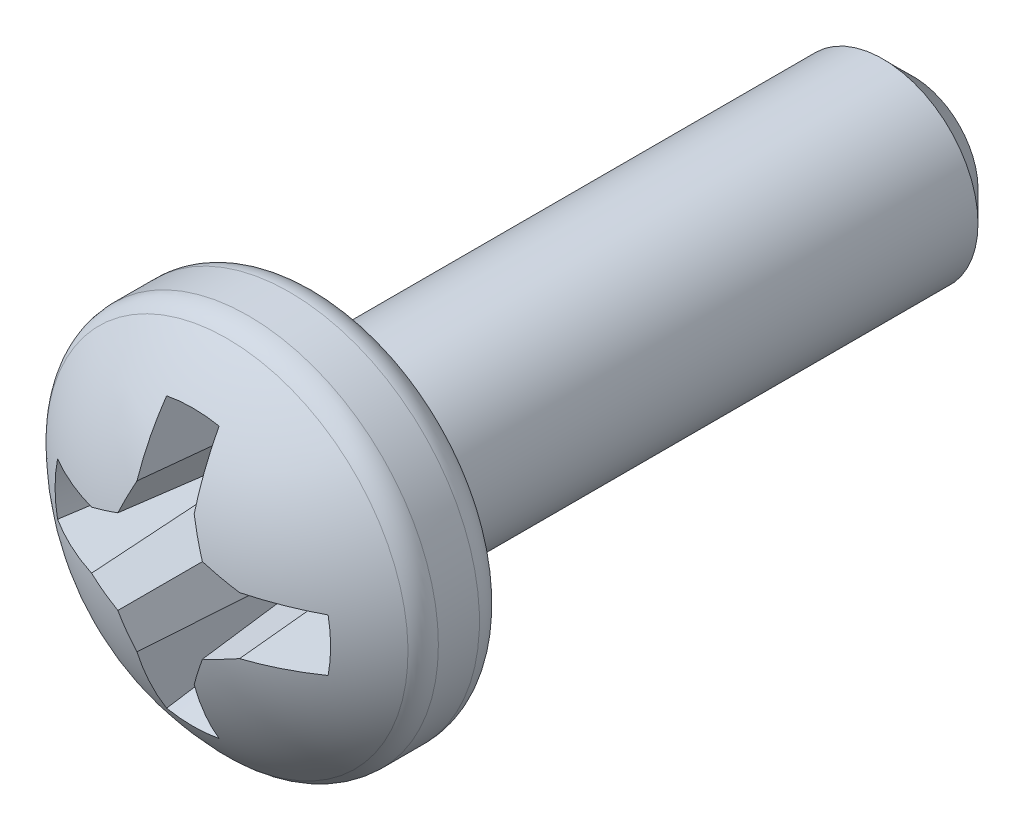
ISO-10303-21;
HEADER;
FILE_DESCRIPTION(('STEP AP214'),'2;1');
FILE_NAME('part.step','',(''),(''),'','','');
FILE_SCHEMA(('AUTOMOTIVE_DESIGN { 1 0 10303 214 1 1 1 1 }'));
ENDSEC;
DATA;
#1=APPLICATION_CONTEXT('core data for automotive mechanical design processes');
#2=APPLICATION_PROTOCOL_DEFINITION('international standard','automotive_design',2000,#1);
#3=PRODUCT_CONTEXT('',#1,'mechanical');
#4=PRODUCT('Part','Part','',(#3));
#5=PRODUCT_RELATED_PRODUCT_CATEGORY('part','',(#4));
#6=PRODUCT_DEFINITION_FORMATION('','',#4);
#7=PRODUCT_DEFINITION_CONTEXT('part definition',#1,'design');
#8=PRODUCT_DEFINITION('design','',#6,#7);
#9=PRODUCT_DEFINITION_SHAPE('','',#8);
#10=(LENGTH_UNIT() NAMED_UNIT(*) SI_UNIT(.MILLI.,.METRE.));
#11=(NAMED_UNIT(*) PLANE_ANGLE_UNIT() SI_UNIT($,.RADIAN.));
#12=(NAMED_UNIT(*) SI_UNIT($,.STERADIAN.) SOLID_ANGLE_UNIT());
#13=UNCERTAINTY_MEASURE_WITH_UNIT(LENGTH_MEASURE(1.E-05),#10,'distance_accuracy_value','');
#14=(GEOMETRIC_REPRESENTATION_CONTEXT(3) GLOBAL_UNCERTAINTY_ASSIGNED_CONTEXT((#13)) GLOBAL_UNIT_ASSIGNED_CONTEXT((#10,
#11,#12)) REPRESENTATION_CONTEXT('',''));
#15=CARTESIAN_POINT('',(0.,0.,0.));
#16=DIRECTION('',(0.,0.,1.));
#17=DIRECTION('',(1.,0.,0.));
#18=AXIS2_PLACEMENT_3D('',#15,#16,#17);
#19=CARTESIAN_POINT('',(-0.572121674615797,0.791461441644268,0.413196607862429));
#20=DIRECTION('',(0.,0.,1.));
#21=DIRECTION('',(1.,0.,0.));
#22=AXIS2_PLACEMENT_3D('',#19,#20,#21);
#23=PLANE('',#22);
#24=DIRECTION('',(0.382683432365081,-0.92387953251129,0.));
#25=VECTOR('',#24,1.);
#26=CARTESIAN_POINT('',(-0.558807787845929,0.796976234112247,0.413196607862429));
#27=LINE('',#26,#25);
#28=CARTESIAN_POINT('',(-0.566378033261302,0.815252423264536,0.413196607862429));
#29=VERTEX_POINT('',#28);
#30=CARTESIAN_POINT('',(-0.561092089679838,0.802491026580226,0.413196607862429));
#31=VERTEX_POINT('',#30);
#32=EDGE_CURVE('E292',#29,#31,#27,.T.);
#33=ORIENTED_EDGE('',*,*,#32,.F.);
#34=DIRECTION('',(0.,1.,0.));
#35=VECTOR('',#34,1.);
#36=CARTESIAN_POINT('',(-0.566378033261302,0.791461441644268,0.413196607862429));
#37=LINE('',#36,#35);
#38=CARTESIAN_POINT('',(-0.566378033261302,0.827667770325216,0.413196607862429));
#39=VERTEX_POINT('',#38);
#40=EDGE_CURVE('E168',#39,#29,#37,.F.);
#41=ORIENTED_EDGE('',*,*,#40,.F.);
#42=CARTESIAN_POINT('',(-0.572121674615797,0.791461441644268,0.413196607862429));
#43=DIRECTION('',(0.,0.,1.));
#44=DIRECTION('',(1.,0.,0.));
#45=AXIS2_PLACEMENT_3D('',#42,#43,#44);
#46=CIRCLE('',#45,0.0366590732638172);
#47=CARTESIAN_POINT('',(-0.577865315970288,0.827667770325217,0.413196607862429));
#48=VERTEX_POINT('',#47);
#49=EDGE_CURVE('E159',#39,#48,#46,.T.);
#50=ORIENTED_EDGE('',*,*,#49,.T.);
#51=DIRECTION('',(0.,1.,0.));
#52=VECTOR('',#51,1.);
#53=CARTESIAN_POINT('',(-0.577865315970287,0.791461441644271,0.413196607862429));
#54=LINE('',#53,#52);
#55=CARTESIAN_POINT('',(-0.577865315970288,0.815252423264539,0.413196607862429));
#56=VERTEX_POINT('',#55);
#57=EDGE_CURVE('E166',#56,#48,#54,.T.);
#58=ORIENTED_EDGE('',*,*,#57,.F.);
#59=DIRECTION('',(0.382683432365079,0.923879532511291,0.));
#60=VECTOR('',#59,1.);
#61=CARTESIAN_POINT('',(-0.585435561385662,0.79697623411225,0.413196607862429));
#62=LINE('',#61,#60);
#63=CARTESIAN_POINT('',(-0.583151259551752,0.802491026580229,0.413196607862429));
#64=VERTEX_POINT('',#63);
#65=EDGE_CURVE('E301',#64,#56,#62,.T.);
#66=ORIENTED_EDGE('',*,*,#65,.F.);
#67=DIRECTION('',(0.923879532511289,0.382683432365086,0.));
#68=VECTOR('',#67,1.);
#69=CARTESIAN_POINT('',(-0.577636467083772,0.804775328414139,0.413196607862429));
#70=LINE('',#69,#68);
#71=CARTESIAN_POINT('',(-0.595912656236062,0.797205082998765,0.413196607862429));
#72=VERTEX_POINT('',#71);
#73=EDGE_CURVE('E307',#72,#64,#70,.T.);
#74=ORIENTED_EDGE('',*,*,#73,.F.);
#75=DIRECTION('',(1.,0.,0.));
#76=VECTOR('',#75,1.);
#77=CARTESIAN_POINT('',(-0.572121674615793,0.797205082998765,0.413196607862429));
#78=LINE('',#77,#76);
#79=CARTESIAN_POINT('',(-0.608328003323473,0.797205082997996,0.413196607853642));
#80=VERTEX_POINT('',#79);
#81=EDGE_CURVE('E313',#80,#72,#78,.T.);
#82=ORIENTED_EDGE('',*,*,#81,.F.);
#83=CARTESIAN_POINT('',(-0.572121674615794,0.791461441644271,0.413196607862429));
#84=DIRECTION('',(0.,0.,1.));
#85=DIRECTION('',(1.,0.,0.));
#86=AXIS2_PLACEMENT_3D('',#83,#84,#85);
#87=CIRCLE('',#86,0.0366590732924525);
#88=CARTESIAN_POINT('',(-0.608328003325736,0.78571780028978,0.413196607862429));
#89=VERTEX_POINT('',#88);
#90=EDGE_CURVE('E410',#80,#89,#87,.T.);
#91=ORIENTED_EDGE('',*,*,#90,.T.);
#92=DIRECTION('',(1.,0.,0.));
#93=VECTOR('',#92,1.);
#94=CARTESIAN_POINT('',(-0.572121674615797,0.78571780028978,0.413196607862429));
#95=LINE('',#94,#93);
#96=CARTESIAN_POINT('',(-0.595912656236065,0.78571780028978,0.413196607862429));
#97=VERTEX_POINT('',#96);
#98=EDGE_CURVE('E247',#97,#89,#95,.F.);
#99=ORIENTED_EDGE('',*,*,#98,.F.);
#100=DIRECTION('',(-0.923879532511292,0.382683432365076,0.));
#101=VECTOR('',#100,1.);
#102=CARTESIAN_POINT('',(-0.577636467083776,0.778147554874406,0.413196607862429));
#103=LINE('',#102,#101);
#104=CARTESIAN_POINT('',(-0.583151259551755,0.780431856708315,0.413196607862429));
#105=VERTEX_POINT('',#104);
#106=EDGE_CURVE('E248',#105,#97,#103,.T.);
#107=ORIENTED_EDGE('',*,*,#106,.F.);
#108=DIRECTION('',(-0.38268343236509,0.923879532511287,0.));
#109=VECTOR('',#108,1.);
#110=CARTESIAN_POINT('',(-0.585435561385666,0.785946649176296,0.413196607862429));
#111=LINE('',#110,#109);
#112=CARTESIAN_POINT('',(-0.577865315970291,0.767670460024005,0.413196607862429));
#113=VERTEX_POINT('',#112);
#114=EDGE_CURVE('E254',#113,#105,#111,.T.);
#115=ORIENTED_EDGE('',*,*,#114,.F.);
#116=DIRECTION('',(0.,1.,0.));
#117=VECTOR('',#116,1.);
#118=CARTESIAN_POINT('',(-0.577865315970291,0.791461441644275,0.413196607862429));
#119=LINE('',#118,#117);
#120=CARTESIAN_POINT('',(-0.57786531597029,0.755255112980816,0.413196607862429));
#121=VERTEX_POINT('',#120);
#122=EDGE_CURVE('E260',#121,#113,#119,.T.);
#123=ORIENTED_EDGE('',*,*,#122,.F.);
#124=CARTESIAN_POINT('',(-0.572121674615796,0.791461441644275,0.413196607862429));
#125=DIRECTION('',(0.,0.,1.));
#126=DIRECTION('',(1.,0.,0.));
#127=AXIS2_PLACEMENT_3D('',#124,#125,#126);
#128=CIRCLE('',#127,0.0366590732465439);
#129=CARTESIAN_POINT('',(-0.566378033261305,0.755255112980815,0.413196607862429));
#130=VERTEX_POINT('',#129);
#131=EDGE_CURVE('E336',#121,#130,#128,.T.);
#132=ORIENTED_EDGE('',*,*,#131,.T.);
#133=DIRECTION('',(0.,1.,0.));
#134=VECTOR('',#133,1.);
#135=CARTESIAN_POINT('',(-0.566378033261306,0.791461441644272,0.413196607862429));
#136=LINE('',#135,#134);
#137=CARTESIAN_POINT('',(-0.566378033261305,0.767670460024002,0.413196607862429));
#138=VERTEX_POINT('',#137);
#139=EDGE_CURVE('E266',#138,#130,#136,.F.);
#140=ORIENTED_EDGE('',*,*,#139,.F.);
#141=DIRECTION('',(-0.382683432365075,-0.923879532511293,0.));
#142=VECTOR('',#141,1.);
#143=CARTESIAN_POINT('',(-0.558807787845931,0.785946649176293,0.413196607862429));
#144=LINE('',#143,#142);
#145=CARTESIAN_POINT('',(-0.561092089679841,0.780431856708313,0.413196607862429));
#146=VERTEX_POINT('',#145);
#147=EDGE_CURVE('E267',#146,#138,#144,.T.);
#148=ORIENTED_EDGE('',*,*,#147,.F.);
#149=DIRECTION('',(-0.923879532511286,-0.382683432365092,0.));
#150=VECTOR('',#149,1.);
#151=CARTESIAN_POINT('',(-0.566606882147821,0.778147554874402,0.413196607862429));
#152=LINE('',#151,#150);
#153=CARTESIAN_POINT('',(-0.548330692995531,0.785717800289777,0.413196607862429));
#154=VERTEX_POINT('',#153);
#155=EDGE_CURVE('E273',#154,#146,#152,.T.);
#156=ORIENTED_EDGE('',*,*,#155,.F.);
#157=DIRECTION('',(1.,0.,0.));
#158=VECTOR('',#157,1.);
#159=CARTESIAN_POINT('',(-0.5721216746158,0.785717800289777,0.413196607862429));
#160=LINE('',#159,#158);
#161=CARTESIAN_POINT('',(-0.535915345934848,0.785717800289777,0.413196607862429));
#162=VERTEX_POINT('',#161);
#163=EDGE_CURVE('E279',#162,#154,#160,.F.);
#164=ORIENTED_EDGE('',*,*,#163,.F.);
#165=CARTESIAN_POINT('',(-0.572121674615797,0.791461441644268,0.413196607862429));
#166=DIRECTION('',(0.,0.,1.));
#167=DIRECTION('',(1.,0.,0.));
#168=AXIS2_PLACEMENT_3D('',#165,#166,#167);
#169=CIRCLE('',#168,0.0366590732638172);
#170=CARTESIAN_POINT('',(-0.535915345934849,0.797205082998762,0.413196607862429));
#171=VERTEX_POINT('',#170);
#172=EDGE_CURVE('E492',#162,#171,#169,.T.);
#173=ORIENTED_EDGE('',*,*,#172,.T.);
#174=DIRECTION('',(1.,0.,0.));
#175=VECTOR('',#174,1.);
#176=CARTESIAN_POINT('',(-0.572121674615797,0.797205082998762,0.413196607862429));
#177=LINE('',#176,#175);
#178=CARTESIAN_POINT('',(-0.548330692995528,0.797205082998762,0.413196607862429));
#179=VERTEX_POINT('',#178);
#180=EDGE_CURVE('E285',#179,#171,#177,.T.);
#181=ORIENTED_EDGE('',*,*,#180,.F.);
#182=DIRECTION('',(0.92387953251129,-0.382683432365083,0.));
#183=VECTOR('',#182,1.);
#184=CARTESIAN_POINT('',(-0.566606882147818,0.804775328414136,0.413196607862429));
#185=LINE('',#184,#183);
#186=EDGE_CURVE('E286',#31,#179,#185,.T.);
#187=ORIENTED_EDGE('',*,*,#186,.F.);
#188=EDGE_LOOP('',(#33,#41,#50,#58,#66,#74,#82,#91,#99,#107,#115,#123,#132,#140,#148,#156,#164,
#173,#181,#187));
#189=FACE_BOUND('',#188,.T.);
#190=ADVANCED_FACE('F17',(#189),#23,.T.);
#191=CARTESIAN_POINT('',(-0.572121674615793,0.801303961329311,0.460047001563216));
#192=DIRECTION('',(0.,-0.996194698091744,0.0871557427476727));
#193=DIRECTION('',(0.,-0.0871557427476727,-0.996194698091744));
#194=AXIS2_PLACEMENT_3D('',#191,#192,#193);
#195=PLANE('',#194);
#196=DIRECTION('',(0.0173337504938623,-0.0871426484044482,-0.996045029063885));
#197=VECTOR('',#196,1.);
#198=CARTESIAN_POINT('',(-0.596656056740422,0.8009424097128,0.455914447676356));
#199=LINE('',#198,#197);
#200=CARTESIAN_POINT('',(-0.596656056740422,0.8009424097128,0.455914447676356));
#201=VERTEX_POINT('',#200);
#202=EDGE_CURVE('E310',#201,#72,#199,.T.);
#203=ORIENTED_EDGE('',*,*,#202,.F.);
#204=CARTESIAN_POINT('',(-0.6169693076876,0.80015108887588,0.446869609122098));
#205=CARTESIAN_POINT('',(-0.613780948004435,0.800321424804083,0.448816557690383));
#206=CARTESIAN_POINT('',(-0.610493997250593,0.800472536171256,0.450543768520713));
#207=CARTESIAN_POINT('',(-0.603722913601554,0.800736309783544,0.453558714705461));
#208=CARTESIAN_POINT('',(-0.600238780706358,0.800848972028658,0.45484645005988));
#209=CARTESIAN_POINT('',(-0.596656056740486,0.800942409712743,0.455914447676343));
#210=B_SPLINE_CURVE_WITH_KNOTS('',3,(#204,#205,#206,#207,#208,#209),.UNSPECIFIED.,.F.,.F.,(4,2,
4),(0.,0.0111485978671279,0.0222971957342559),.UNSPECIFIED.);
#211=CARTESIAN_POINT('',(-0.616969307677023,0.800151088874493,0.446869609106245));
#212=VERTEX_POINT('',#211);
#213=EDGE_CURVE('E409',#212,#201,#210,.T.);
#214=ORIENTED_EDGE('',*,*,#213,.F.);
#215=CARTESIAN_POINT('',(-0.616969307666445,0.800151088873107,0.446869609090391));
#216=CARTESIAN_POINT('',(-0.615532839888683,0.79966000435443,0.441256487356838));
#217=CARTESIAN_POINT('',(-0.614094497313129,0.799168961608414,0.435643843086986));
#218=CARTESIAN_POINT('',(-0.611214062531476,0.798186959649785,0.424419509338453));
#219=CARTESIAN_POINT('',(-0.609771970325285,0.797696000437175,0.418807819859794));
#220=CARTESIAN_POINT('',(-0.608328003321212,0.797205082997228,0.413196607844861));
#221=B_SPLINE_CURVE_WITH_KNOTS('',3,(#215,#216,#217,#218,#219,#220),.UNSPECIFIED.,.F.,.F.,(4,2,
4),(0.,0.0174443558891329,0.0348887122017161),.UNSPECIFIED.);
#222=EDGE_CURVE('E318',#212,#80,#221,.T.);
#223=ORIENTED_EDGE('',*,*,#222,.T.);
#224=ORIENTED_EDGE('',*,*,#81,.T.);
#225=EDGE_LOOP('',(#203,#214,#223,#224));
#226=FACE_BOUND('',#225,.T.);
#227=ADVANCED_FACE('F427',(#226),#195,.T.);
#228=CARTESIAN_POINT('',(-0.579205039912152,0.808562198209984,0.460047001563216));
#229=DIRECTION('',(0.381227206369649,-0.920363891963225,0.0871557427476661));
#230=DIRECTION('',(0.923879532511289,0.382683432365086,0.));
#231=AXIS2_PLACEMENT_3D('',#228,#229,#230);
#232=PLANE('',#231);
#233=DIRECTION('',(0.0666626913468223,-0.0666626913468416,-0.995546167269401));
#234=VECTOR('',#233,1.);
#235=CARTESIAN_POINT('',(-0.586133038303313,0.805472805331791,0.457726739301586));
#236=LINE('',#235,#234);
#237=CARTESIAN_POINT('',(-0.586133038303313,0.805472805331791,0.457726739301586));
#238=VERTEX_POINT('',#237);
#239=EDGE_CURVE('E304',#238,#64,#236,.T.);
#240=ORIENTED_EDGE('',*,*,#239,.F.);
#241=CARTESIAN_POINT('',(-0.596656056740422,0.8009424097128,0.455914447676356));
#242=CARTESIAN_POINT('',(-0.594925687185487,0.801700049456702,0.456346321822599));
#243=CARTESIAN_POINT('',(-0.593183584204927,0.802456402296903,0.456713283197823));
#244=CARTESIAN_POINT('',(-0.589675911392557,0.8039665341699,0.457317380406233));
#245=CARTESIAN_POINT('',(-0.587910341560748,0.804720313202696,0.457554516239419));
#246=CARTESIAN_POINT('',(-0.586133038303313,0.805472805331791,0.457726739301586));
#247=B_SPLINE_CURVE_WITH_KNOTS('',3,(#241,#242,#243,#244,#245,#246),.UNSPECIFIED.,.F.,.F.,(4,2,
4),(0.,0.00580300590917765,0.0116060118183553),.UNSPECIFIED.);
#248=EDGE_CURVE('E439',#201,#238,#247,.T.);
#249=ORIENTED_EDGE('',*,*,#248,.F.);
#250=ORIENTED_EDGE('',*,*,#202,.T.);
#251=ORIENTED_EDGE('',*,*,#73,.T.);
#252=EDGE_LOOP('',(#240,#249,#250,#251));
#253=FACE_BOUND('',#252,.T.);
#254=ADVANCED_FACE('F431',(#253),#232,.T.);
#255=CARTESIAN_POINT('',(-0.589222431181506,0.79854480694063,0.460047001563216));
#256=DIRECTION('',(0.920363891963229,-0.381227206369643,0.0871557427476506));
#257=DIRECTION('',(0.382683432365079,0.923879532511291,0.));
#258=AXIS2_PLACEMENT_3D('',#255,#256,#257);
#259=PLANE('',#258);
#260=DIRECTION('',(0.0871426484044276,-0.0173337504938855,-0.996045029063886));
#261=VECTOR('',#260,1.);
#262=CARTESIAN_POINT('',(-0.581602642684322,0.8159958237689,0.455914447676355));
#263=LINE('',#262,#261);
#264=CARTESIAN_POINT('',(-0.581602642684322,0.8159958237689,0.455914447676355));
#265=VERTEX_POINT('',#264);
#266=EDGE_CURVE('E176',#265,#56,#263,.T.);
#267=ORIENTED_EDGE('',*,*,#266,.F.);
#268=CARTESIAN_POINT('',(-0.586133038303313,0.805472805331791,0.457726739301586));
#269=CARTESIAN_POINT('',(-0.585380546174218,0.807250108589226,0.457554516239419));
#270=CARTESIAN_POINT('',(-0.584626767141422,0.809015678421036,0.457317380406233));
#271=CARTESIAN_POINT('',(-0.583116635268425,0.812523351233405,0.456713283197822));
#272=CARTESIAN_POINT('',(-0.582360282428225,0.814265454213965,0.456346321822598));
#273=CARTESIAN_POINT('',(-0.581602642684322,0.8159958237689,0.455914447676355));
#274=B_SPLINE_CURVE_WITH_KNOTS('',3,(#268,#269,#270,#271,#272,#273),.UNSPECIFIED.,.F.,.F.,(4,2,
4),(0.,0.00580300590917793,0.0116060118183555),.UNSPECIFIED.);
#275=EDGE_CURVE('E445',#238,#265,#274,.T.);
#276=ORIENTED_EDGE('',*,*,#275,.F.);
#277=ORIENTED_EDGE('',*,*,#239,.T.);
#278=ORIENTED_EDGE('',*,*,#65,.T.);
#279=EDGE_LOOP('',(#267,#276,#277,#278));
#280=FACE_BOUND('',#279,.T.);
#281=ADVANCED_FACE('F436',(#280),#259,.T.);
#282=CARTESIAN_POINT('',(-0.581964194300832,0.791461441644271,0.460047001563216));
#283=DIRECTION('',(0.996194698091747,0.,0.0871557427476441));
#284=DIRECTION('',(0.0871557427476441,0.,-0.996194698091747));
#285=AXIS2_PLACEMENT_3D('',#282,#283,#284);
#286=PLANE('',#285);
#287=CARTESIAN_POINT('',(-0.577865315968952,0.827667770321288,0.413196607847166));
#288=CARTESIAN_POINT('',(-0.578356233408867,0.829111737330029,0.418807819861725));
#289=CARTESIAN_POINT('',(-0.578847192621444,0.830553829540901,0.424419509340005));
#290=CARTESIAN_POINT('',(-0.579829194580005,0.83343426433195,0.435643843087779));
#291=CARTESIAN_POINT('',(-0.580320237325988,0.834872606912218,0.441256487357249));
#292=CARTESIAN_POINT('',(-0.580811321844631,0.836309074694709,0.446869609090417));
#293=B_SPLINE_CURVE_WITH_KNOTS('',3,(#287,#288,#289,#290,#291,#292),.UNSPECIFIED.,.F.,.F.,(4,2,
4),(0.,0.0174443563149653,0.0348887122064803),.UNSPECIFIED.);
#294=CARTESIAN_POINT('',(-0.580811321842855,0.836309074689514,0.446869609070122));
#295=VERTEX_POINT('',#294);
#296=EDGE_CURVE('E170',#48,#295,#293,.T.);
#297=ORIENTED_EDGE('',*,*,#296,.T.);
#298=CARTESIAN_POINT('',(-0.581602642684322,0.8159958237689,0.455914447676355));
#299=CARTESIAN_POINT('',(-0.581509205000208,0.819578547734767,0.454846450059899));
#300=CARTESIAN_POINT('',(-0.581396542755076,0.823062680629957,0.453558714705488));
#301=CARTESIAN_POINT('',(-0.581132769142773,0.829833764278985,0.450543768520753));
#302=CARTESIAN_POINT('',(-0.580981657775602,0.833120715032823,0.44881655769043));
#303=CARTESIAN_POINT('',(-0.580811321847412,0.836309074715984,0.446869609122151));
#304=B_SPLINE_CURVE_WITH_KNOTS('',3,(#298,#299,#300,#301,#302,#303),.UNSPECIFIED.,.F.,.F.,(4,2,
4),(0.,0.0111485978671061,0.0222971957342125),.UNSPECIFIED.);
#305=EDGE_CURVE('E450',#265,#295,#304,.T.);
#306=ORIENTED_EDGE('',*,*,#305,.F.);
#307=ORIENTED_EDGE('',*,*,#266,.T.);
#308=ORIENTED_EDGE('',*,*,#57,.T.);
#309=EDGE_LOOP('',(#297,#306,#307,#308));
#310=FACE_BOUND('',#309,.T.);
#311=ADVANCED_FACE('F173',(#310),#286,.T.);
#312=CARTESIAN_POINT('',(-0.572121674615797,0.791461441644268,0.446869608879297));
#313=DIRECTION('',(0.,0.,1.));
#314=DIRECTION('',(1.,0.,0.));
#315=AXIS2_PLACEMENT_3D('',#312,#313,#314);
#316=CONICAL_SURFACE('',#315,0.0456817266970083,0.261799387909679);
#317=ORIENTED_EDGE('',*,*,#296,.F.);
#318=ORIENTED_EDGE('',*,*,#49,.F.);
#319=CARTESIAN_POINT('',(-0.563432027384733,0.836309074701222,0.446869609115863));
#320=CARTESIAN_POINT('',(-0.563923111903585,0.834872606918124,0.441256487380304));
#321=CARTESIAN_POINT('',(-0.564414154649776,0.833434264337248,0.435643843108444));
#322=CARTESIAN_POINT('',(-0.565396156608756,0.83055382954498,0.424419509355889));
#323=CARTESIAN_POINT('',(-0.565887115821543,0.829111737333497,0.418807819875219));
#324=CARTESIAN_POINT('',(-0.566378033261666,0.827667770324146,0.41319660785827));
#325=B_SPLINE_CURVE_WITH_KNOTS('',3,(#319,#320,#321,#322,#323,#324),.UNSPECIFIED.,.F.,.F.,(4,2,
4),(0.,0.0174443558989419,0.0348887122213341),.UNSPECIFIED.);
#326=CARTESIAN_POINT('',(-0.563432027384246,0.836309074704657,0.44686960912142));
#327=VERTEX_POINT('',#326);
#328=EDGE_CURVE('E182',#327,#39,#325,.T.);
#329=ORIENTED_EDGE('',*,*,#328,.F.);
#330=CARTESIAN_POINT('',(-0.572121674615797,0.791461441644268,0.446869609049827));
#331=DIRECTION('',(0.,0.,1.));
#332=DIRECTION('',(1.,0.,0.));
#333=AXIS2_PLACEMENT_3D('',#330,#331,#332);
#334=CIRCLE('',#333,0.0456817267427018);
#335=EDGE_CURVE('E180',#295,#327,#334,.F.);
#336=ORIENTED_EDGE('',*,*,#335,.F.);
#337=EDGE_LOOP('',(#317,#318,#329,#336));
#338=FACE_BOUND('',#337,.T.);
#339=ADVANCED_FACE('F178',(#338),#316,.F.);
#340=CARTESIAN_POINT('',(-0.562279154930757,0.791461441644268,0.460047001563216));
#341=DIRECTION('',(-0.996194698091746,0.,0.0871557427476584));
#342=DIRECTION('',(0.0871557427476584,0.,0.996194698091746));
#343=AXIS2_PLACEMENT_3D('',#340,#341,#342);
#344=PLANE('',#343);
#345=DIRECTION('',(-0.0871426484044405,-0.0173337504938649,-0.996045029063885));
#346=VECTOR('',#345,1.);
#347=CARTESIAN_POINT('',(-0.562640706547268,0.815995823768896,0.455914447676356));
#348=LINE('',#347,#346);
#349=CARTESIAN_POINT('',(-0.562640706547268,0.815995823768896,0.455914447676356));
#350=VERTEX_POINT('',#349);
#351=EDGE_CURVE('E295',#350,#29,#348,.T.);
#352=ORIENTED_EDGE('',*,*,#351,.F.);
#353=CARTESIAN_POINT('',(-0.56343202738376,0.836309074708093,0.446869609126976));
#354=CARTESIAN_POINT('',(-0.56326169145567,0.833120715026061,0.448816557694096));
#355=CARTESIAN_POINT('',(-0.563110580088584,0.829833764273447,0.450543768523437));
#356=CARTESIAN_POINT('',(-0.562846806476417,0.823062680627053,0.453558714706562));
#357=CARTESIAN_POINT('',(-0.562734144231338,0.819578547733273,0.454846450060346));
#358=CARTESIAN_POINT('',(-0.562640706547262,0.81599582376891,0.45591444767635));
#359=B_SPLINE_CURVE_WITH_KNOTS('',3,(#353,#354,#355,#356,#357,#358),.UNSPECIFIED.,.F.,.F.,(4,2,
4),(0.,0.0111485978624812,0.0222971957249623),.UNSPECIFIED.);
#360=EDGE_CURVE('E210',#327,#350,#359,.T.);
#361=ORIENTED_EDGE('',*,*,#360,.F.);
#362=ORIENTED_EDGE('',*,*,#328,.T.);
#363=ORIENTED_EDGE('',*,*,#40,.T.);
#364=EDGE_LOOP('',(#352,#361,#362,#363));
#365=FACE_BOUND('',#364,.T.);
#366=ADVANCED_FACE('F199',(#365),#344,.T.);
#367=CARTESIAN_POINT('',(-0.555020918050084,0.798544806940627,0.460047001563216));
#368=DIRECTION('',(-0.920363891963228,-0.381227206369645,0.0871557427476584));
#369=DIRECTION('',(0.382683432365081,-0.92387953251129,0.));
#370=AXIS2_PLACEMENT_3D('',#367,#368,#369);
#371=PLANE('',#370);
#372=DIRECTION('',(-0.0666626913468174,-0.0666626913468417,-0.995546167269401));
#373=VECTOR('',#372,1.);
#374=CARTESIAN_POINT('',(-0.558110310928277,0.805472805331788,0.457726739301586));
#375=LINE('',#374,#373);
#376=CARTESIAN_POINT('',(-0.558110310928277,0.805472805331788,0.457726739301586));
#377=VERTEX_POINT('',#376);
#378=EDGE_CURVE('E289',#377,#31,#375,.T.);
#379=ORIENTED_EDGE('',*,*,#378,.F.);
#380=CARTESIAN_POINT('',(-0.562640706547268,0.815995823768896,0.455914447676356));
#381=CARTESIAN_POINT('',(-0.561883066803365,0.814265454213961,0.456346321822598));
#382=CARTESIAN_POINT('',(-0.561126713963165,0.812523351233401,0.456713283197823));
#383=CARTESIAN_POINT('',(-0.559616582090168,0.809015678421032,0.457317380406233));
#384=CARTESIAN_POINT('',(-0.558862803057372,0.807250108589223,0.457554516239419));
#385=CARTESIAN_POINT('',(-0.558110310928277,0.805472805331788,0.457726739301586));
#386=B_SPLINE_CURVE_WITH_KNOTS('',3,(#380,#381,#382,#383,#384,#385),.UNSPECIFIED.,.F.,.F.,(4,2,
4),(0.,0.00580300590917684,0.0116060118183539),.UNSPECIFIED.);
#387=EDGE_CURVE('E218',#350,#377,#386,.T.);
#388=ORIENTED_EDGE('',*,*,#387,.F.);
#389=ORIENTED_EDGE('',*,*,#351,.T.);
#390=ORIENTED_EDGE('',*,*,#32,.T.);
#391=EDGE_LOOP('',(#379,#388,#389,#390));
#392=FACE_BOUND('',#391,.T.);
#393=ADVANCED_FACE('F204',(#392),#371,.T.);
#394=CARTESIAN_POINT('',(-0.565038309319438,0.808562198209981,0.460047001563216));
#395=DIRECTION('',(-0.381227206369647,-0.920363891963227,0.0871557427476583));
#396=DIRECTION('',(0.92387953251129,-0.382683432365083,0.));
#397=AXIS2_PLACEMENT_3D('',#394,#395,#396);
#398=PLANE('',#397);
#399=DIRECTION('',(-0.0173337504938598,-0.0871426484044405,-0.996045029063885));
#400=VECTOR('',#399,1.);
#401=CARTESIAN_POINT('',(-0.547587292491168,0.800942409712797,0.455914447676356));
#402=LINE('',#401,#400);
#403=CARTESIAN_POINT('',(-0.547587292491168,0.800942409712797,0.455914447676356));
#404=VERTEX_POINT('',#403);
#405=EDGE_CURVE('E282',#404,#179,#402,.T.);
#406=ORIENTED_EDGE('',*,*,#405,.F.);
#407=CARTESIAN_POINT('',(-0.558110310928277,0.805472805331788,0.457726739301586));
#408=CARTESIAN_POINT('',(-0.556333007670842,0.804720313202693,0.457554516239419));
#409=CARTESIAN_POINT('',(-0.554567437839033,0.803966534169897,0.457317380406233));
#410=CARTESIAN_POINT('',(-0.551059765026663,0.8024564022969,0.456713283197822));
#411=CARTESIAN_POINT('',(-0.549317662046103,0.801700049456699,0.456346321822598));
#412=CARTESIAN_POINT('',(-0.547587292491168,0.800942409712797,0.455914447676355));
#413=B_SPLINE_CURVE_WITH_KNOTS('',3,(#407,#408,#409,#410,#411,#412),.UNSPECIFIED.,.F.,.F.,(4,2,
4),(0.,0.0058030059091779,0.0116060118183556),.UNSPECIFIED.);
#414=EDGE_CURVE('E462',#377,#404,#413,.T.);
#415=ORIENTED_EDGE('',*,*,#414,.F.);
#416=ORIENTED_EDGE('',*,*,#378,.T.);
#417=ORIENTED_EDGE('',*,*,#186,.T.);
#418=EDGE_LOOP('',(#406,#415,#416,#417));
#419=FACE_BOUND('',#418,.T.);
#420=ADVANCED_FACE('F474',(#419),#398,.T.);
#421=CARTESIAN_POINT('',(-0.572121674615797,0.801303961329307,0.460047001563216));
#422=DIRECTION('',(0.,-0.996194698091746,0.0871557427476584));
#423=DIRECTION('',(0.,-0.0871557427476584,-0.996194698091746));
#424=AXIS2_PLACEMENT_3D('',#421,#422,#423);
#425=PLANE('',#424);
#426=CARTESIAN_POINT('',(-0.535915345938917,0.797205082997379,0.413196607846626));
#427=CARTESIAN_POINT('',(-0.534471378930153,0.797696000437301,0.418807819861274));
#428=CARTESIAN_POINT('',(-0.533029286719257,0.798186959649887,0.424419509339645));
#429=CARTESIAN_POINT('',(-0.530148851928162,0.799168961608464,0.435643843087599));
#430=CARTESIAN_POINT('',(-0.528710509347871,0.799660004354454,0.441256487357158));
#431=CARTESIAN_POINT('',(-0.527274041565357,0.800151088873105,0.446869609090417));
#432=B_SPLINE_CURVE_WITH_KNOTS('',3,(#426,#427,#428,#429,#430,#431),.UNSPECIFIED.,.F.,.F.,(4,2,
4),(0.,0.0174443563152455,0.0348887122070405),.UNSPECIFIED.);
#433=CARTESIAN_POINT('',(-0.527274041570552,0.80015108887133,0.446869609070122));
#434=VERTEX_POINT('',#433);
#435=EDGE_CURVE('E351',#171,#434,#432,.T.);
#436=ORIENTED_EDGE('',*,*,#435,.T.);
#437=CARTESIAN_POINT('',(-0.547587292491168,0.800942409712797,0.455914447676355));
#438=CARTESIAN_POINT('',(-0.544004568525289,0.800848972028702,0.454846450059894));
#439=CARTESIAN_POINT('',(-0.540520435630086,0.800736309783569,0.453558714705477));
#440=CARTESIAN_POINT('',(-0.533749351981035,0.800472536171226,0.450543768520734));
#441=CARTESIAN_POINT('',(-0.530462401227186,0.800321424804016,0.448816557690407));
#442=CARTESIAN_POINT('',(-0.527274041544015,0.800151088875768,0.446869609122124));
#443=B_SPLINE_CURVE_WITH_KNOTS('',3,(#437,#438,#439,#440,#441,#442),.UNSPECIFIED.,.F.,.F.,(4,2,
4),(0.,0.0111485978671457,0.0222971957342915),.UNSPECIFIED.);
#444=EDGE_CURVE('E463',#404,#434,#443,.T.);
#445=ORIENTED_EDGE('',*,*,#444,.F.);
#446=ORIENTED_EDGE('',*,*,#405,.T.);
#447=ORIENTED_EDGE('',*,*,#180,.T.);
#448=EDGE_LOOP('',(#436,#445,#446,#447));
#449=FACE_BOUND('',#448,.T.);
#450=ADVANCED_FACE('F477',(#449),#425,.T.);
#451=CARTESIAN_POINT('',(-0.572121674615797,0.791461441644268,0.446869608879297));
#452=DIRECTION('',(0.,0.,1.));
#453=DIRECTION('',(1.,0.,0.));
#454=AXIS2_PLACEMENT_3D('',#451,#452,#453);
#455=CONICAL_SURFACE('',#454,0.0456817266970083,0.261799387909679);
#456=ORIENTED_EDGE('',*,*,#172,.F.);
#457=CARTESIAN_POINT('',(-0.527274041558843,0.782771794413208,0.446869609115863));
#458=CARTESIAN_POINT('',(-0.528710509341964,0.783262878932068,0.441256487380214));
#459=CARTESIAN_POINT('',(-0.530148851922863,0.783753921678267,0.435643843108263));
#460=CARTESIAN_POINT('',(-0.533029286715177,0.784735923637263,0.424419509355529));
#461=CARTESIAN_POINT('',(-0.534471378926683,0.785226882850057,0.418807819874768));
#462=CARTESIAN_POINT('',(-0.535915345936058,0.785717800290188,0.41319660785773));
#463=B_SPLINE_CURVE_WITH_KNOTS('',3,(#457,#458,#459,#460,#461,#462),.UNSPECIFIED.,.F.,.F.,(4,2,
4),(0.,0.0174443558992221,0.0348887122218945),.UNSPECIFIED.);
#464=CARTESIAN_POINT('',(-0.527274041555407,0.782771794412722,0.44686960912142));
#465=VERTEX_POINT('',#464);
#466=EDGE_CURVE('E346',#465,#162,#463,.T.);
#467=ORIENTED_EDGE('',*,*,#466,.F.);
#468=CARTESIAN_POINT('',(-0.572121674615797,0.791461441644268,0.446869609049827));
#469=DIRECTION('',(0.,0.,1.));
#470=DIRECTION('',(1.,0.,0.));
#471=AXIS2_PLACEMENT_3D('',#468,#469,#470);
#472=CIRCLE('',#471,0.0456817267427018);
#473=EDGE_CURVE('E464',#434,#465,#472,.F.);
#474=ORIENTED_EDGE('',*,*,#473,.F.);
#475=ORIENTED_EDGE('',*,*,#435,.F.);
#476=EDGE_LOOP('',(#456,#467,#474,#475));
#477=FACE_BOUND('',#476,.T.);
#478=ADVANCED_FACE('F482',(#477),#455,.F.);
#479=CARTESIAN_POINT('',(-0.5721216746158,0.781618921959232,0.460047001563216));
#480=DIRECTION('',(0.,0.996194698091747,0.0871557427476441));
#481=DIRECTION('',(0.,-0.0871557427476441,0.996194698091747));
#482=AXIS2_PLACEMENT_3D('',#479,#480,#481);
#483=PLANE('',#482);
#484=DIRECTION('',(-0.0173337504938443,0.0871426484044235,-0.996045029063887));
#485=VECTOR('',#484,1.);
#486=CARTESIAN_POINT('',(-0.547587292491172,0.781980473575742,0.455914447676357));
#487=LINE('',#486,#485);
#488=CARTESIAN_POINT('',(-0.547587292491172,0.781980473575742,0.455914447676357));
#489=VERTEX_POINT('',#488);
#490=EDGE_CURVE('E276',#489,#154,#487,.T.);
#491=ORIENTED_EDGE('',*,*,#490,.F.);
#492=CARTESIAN_POINT('',(-0.527274041551971,0.782771794412236,0.446869609126976));
#493=CARTESIAN_POINT('',(-0.530462401233996,0.782601458484136,0.448816557694091));
#494=CARTESIAN_POINT('',(-0.533749351986603,0.782450347117049,0.450543768523429));
#495=CARTESIAN_POINT('',(-0.540520435632982,0.782186573504904,0.453558714706552));
#496=CARTESIAN_POINT('',(-0.544004568526754,0.782073911259845,0.454846450060336));
#497=CARTESIAN_POINT('',(-0.547587292491108,0.7819804735758,0.455914447676344));
#498=B_SPLINE_CURVE_WITH_KNOTS('',3,(#492,#493,#494,#495,#496,#497),.UNSPECIFIED.,.F.,.F.,(4,2,
4),(0.,0.0111485978624582,0.0222971957249163),.UNSPECIFIED.);
#499=EDGE_CURVE('E509',#465,#489,#498,.T.);
#500=ORIENTED_EDGE('',*,*,#499,.F.);
#501=ORIENTED_EDGE('',*,*,#466,.T.);
#502=ORIENTED_EDGE('',*,*,#163,.T.);
#503=EDGE_LOOP('',(#491,#500,#501,#502));
#504=FACE_BOUND('',#503,.T.);
#505=ADVANCED_FACE('F499',(#504),#483,.T.);
#506=CARTESIAN_POINT('',(-0.565038309319441,0.774360685078558,0.460047001563216));
#507=DIRECTION('',(-0.381227206369656,0.920363891963225,0.0871557427476397));
#508=DIRECTION('',(-0.923879532511286,-0.382683432365092,0.));
#509=AXIS2_PLACEMENT_3D('',#506,#507,#508);
#510=PLANE('',#509);
#511=DIRECTION('',(-0.066662691346817,0.0666626913468194,-0.995546167269403));
#512=VECTOR('',#511,1.);
#513=CARTESIAN_POINT('',(-0.55811031092828,0.777450077956752,0.457726739301588));
#514=LINE('',#513,#512);
#515=CARTESIAN_POINT('',(-0.55811031092828,0.777450077956752,0.457726739301588));
#516=VERTEX_POINT('',#515);
#517=EDGE_CURVE('E270',#516,#146,#514,.T.);
#518=ORIENTED_EDGE('',*,*,#517,.F.);
#519=CARTESIAN_POINT('',(-0.547587292491172,0.781980473575742,0.455914447676357));
#520=CARTESIAN_POINT('',(-0.549317662046106,0.78122283383184,0.4563463218226));
#521=CARTESIAN_POINT('',(-0.551059765026666,0.780466480991639,0.456713283197824));
#522=CARTESIAN_POINT('',(-0.554567437839035,0.778956349118642,0.457317380406234));
#523=CARTESIAN_POINT('',(-0.556333007670845,0.778202570085846,0.45755451623942));
#524=CARTESIAN_POINT('',(-0.55811031092828,0.777450077956751,0.457726739301587));
#525=B_SPLINE_CURVE_WITH_KNOTS('',3,(#519,#520,#521,#522,#523,#524),.UNSPECIFIED.,.F.,.F.,(4,2,
4),(0.,0.00580300590917706,0.0116060118183544),.UNSPECIFIED.);
#526=EDGE_CURVE('E515',#489,#516,#525,.T.);
#527=ORIENTED_EDGE('',*,*,#526,.F.);
#528=ORIENTED_EDGE('',*,*,#490,.T.);
#529=ORIENTED_EDGE('',*,*,#155,.T.);
#530=EDGE_LOOP('',(#518,#527,#528,#529));
#531=FACE_BOUND('',#530,.T.);
#532=ADVANCED_FACE('F503',(#531),#510,.T.);
#533=CARTESIAN_POINT('',(-0.555020918050087,0.784378076347913,0.460047001563216));
#534=DIRECTION('',(-0.920363891963232,0.381227206369639,0.0871557427476397));
#535=DIRECTION('',(-0.382683432365075,-0.923879532511293,0.));
#536=AXIS2_PLACEMENT_3D('',#533,#534,#535);
#537=PLANE('',#536);
#538=DIRECTION('',(-0.0871426484044258,0.0173337504938366,-0.996045029063887));
#539=VECTOR('',#538,1.);
#540=CARTESIAN_POINT('',(-0.562640706547271,0.766927059519643,0.455914447676357));
#541=LINE('',#540,#539);
#542=CARTESIAN_POINT('',(-0.562640706547271,0.766927059519643,0.455914447676357));
#543=VERTEX_POINT('',#542);
#544=EDGE_CURVE('E263',#543,#138,#541,.T.);
#545=ORIENTED_EDGE('',*,*,#544,.F.);
#546=CARTESIAN_POINT('',(-0.55811031092828,0.777450077956752,0.457726739301587));
#547=CARTESIAN_POINT('',(-0.558862803057374,0.775672774699317,0.45755451623942));
#548=CARTESIAN_POINT('',(-0.559616582090171,0.773907204867508,0.457317380406234));
#549=CARTESIAN_POINT('',(-0.561126713963168,0.770399532055138,0.456713283197824));
#550=CARTESIAN_POINT('',(-0.561883066803368,0.768657429074578,0.4563463218226));
#551=CARTESIAN_POINT('',(-0.562640706547271,0.766927059519643,0.455914447676357));
#552=B_SPLINE_CURVE_WITH_KNOTS('',3,(#546,#547,#548,#549,#550,#551),.UNSPECIFIED.,.F.,.F.,(4,2,
4),(0.,0.00580300590917769,0.0116060118183554),.UNSPECIFIED.);
#553=EDGE_CURVE('E535',#516,#543,#552,.T.);
#554=ORIENTED_EDGE('',*,*,#553,.F.);
#555=ORIENTED_EDGE('',*,*,#517,.T.);
#556=ORIENTED_EDGE('',*,*,#147,.T.);
#557=EDGE_LOOP('',(#545,#554,#555,#556));
#558=FACE_BOUND('',#557,.T.);
#559=ADVANCED_FACE('F548',(#558),#537,.T.);
#560=CARTESIAN_POINT('',(-0.562279154930761,0.791461441644272,0.460047001563216));
#561=DIRECTION('',(-0.996194698091747,0.,0.0871557427476441));
#562=DIRECTION('',(0.0871557427476441,0.,0.996194698091747));
#563=AXIS2_PLACEMENT_3D('',#560,#561,#562);
#564=PLANE('',#563);
#565=CARTESIAN_POINT('',(-0.566378033259504,0.755255112975516,0.413196607883015));
#566=CARTESIAN_POINT('',(-0.565887115819717,0.753811145964264,0.418807819896122));
#567=CARTESIAN_POINT('',(-0.565396156607267,0.752369053750869,0.42441950937295));
#568=CARTESIAN_POINT('',(-0.56441415464896,0.749488618954753,0.435643843117813));
#569=CARTESIAN_POINT('',(-0.563923111903105,0.74805027637194,0.441256487385826));
#570=CARTESIAN_POINT('',(-0.56343202738459,0.746613808586894,0.446869609117536));
#571=B_SPLINE_CURVE_WITH_KNOTS('',3,(#565,#566,#567,#568,#569,#570),.UNSPECIFIED.,.F.,.F.,(4,2,
4),(0.,0.0174443563126026,0.0348887122017549),.UNSPECIFIED.);
#572=CARTESIAN_POINT('',(-0.563432027385065,0.746613808588284,0.446869609112103));
#573=VERTEX_POINT('',#572);
#574=EDGE_CURVE('E559',#130,#573,#571,.T.);
#575=ORIENTED_EDGE('',*,*,#574,.T.);
#576=CARTESIAN_POINT('',(-0.562640706547271,0.766927059519643,0.455914447676357));
#577=CARTESIAN_POINT('',(-0.56273414423134,0.763344335555466,0.454846450060408));
#578=CARTESIAN_POINT('',(-0.562846806476411,0.75986020266186,0.453558714706702));
#579=CARTESIAN_POINT('',(-0.563110580088556,0.753089119015789,0.450543768523777));
#580=CARTESIAN_POINT('',(-0.56326169145563,0.749802168263325,0.448816557694558));
#581=CARTESIAN_POINT('',(-0.563432027383706,0.746613808581433,0.446869609127581));
#582=B_SPLINE_CURVE_WITH_KNOTS('',3,(#576,#577,#578,#579,#580,#581),.UNSPECIFIED.,.F.,.F.,(4,2,
4),(0.,0.011148597861911,0.0222971957238219),.UNSPECIFIED.);
#583=EDGE_CURVE('E536',#543,#573,#582,.T.);
#584=ORIENTED_EDGE('',*,*,#583,.F.);
#585=ORIENTED_EDGE('',*,*,#544,.T.);
#586=ORIENTED_EDGE('',*,*,#139,.T.);
#587=EDGE_LOOP('',(#575,#584,#585,#586));
#588=FACE_BOUND('',#587,.T.);
#589=ADVANCED_FACE('F551',(#588),#564,.T.);
#590=CARTESIAN_POINT('',(-0.572121674615796,0.791461441644275,0.446869608879296));
#591=DIRECTION('',(0.,0.,1.));
#592=DIRECTION('',(1.,0.,0.));
#593=AXIS2_PLACEMENT_3D('',#590,#591,#592);
#594=CONICAL_SURFACE('',#593,0.0456817266970071,0.261799388388261);
#595=ORIENTED_EDGE('',*,*,#131,.F.);
#596=CARTESIAN_POINT('',(-0.580811321847688,0.7466138085849,0.446869609125327));
#597=CARTESIAN_POINT('',(-0.580320237328912,0.748050276370707,0.441256487390638));
#598=CARTESIAN_POINT('',(-0.579829194582796,0.749488618954282,0.435643843119648));
#599=CARTESIAN_POINT('',(-0.578847192623968,0.752369053751928,0.424419509368829));
#600=CARTESIAN_POINT('',(-0.578356233411258,0.753811145966089,0.418807819889025));
#601=CARTESIAN_POINT('',(-0.57786531597121,0.75525511297811,0.413196607872941));
#602=B_SPLINE_CURVE_WITH_KNOTS('',3,(#596,#597,#598,#599,#600,#601),.UNSPECIFIED.,.F.,.F.,(4,2,
4),(0.,0.0174443558984079,0.0348887122202661),.UNSPECIFIED.);
#603=CARTESIAN_POINT('',(-0.580811321847825,0.74661380858388,0.44686960912689));
#604=VERTEX_POINT('',#603);
#605=EDGE_CURVE('E331',#604,#121,#602,.T.);
#606=ORIENTED_EDGE('',*,*,#605,.F.);
#607=CARTESIAN_POINT('',(-0.572121674615796,0.791461441644275,0.44686960910667));
#608=DIRECTION('',(0.,0.,1.));
#609=DIRECTION('',(1.,0.,0.));
#610=AXIS2_PLACEMENT_3D('',#607,#608,#609);
#611=CIRCLE('',#610,0.0456817267579317);
#612=EDGE_CURVE('E538',#573,#604,#611,.F.);
#613=ORIENTED_EDGE('',*,*,#612,.F.);
#614=ORIENTED_EDGE('',*,*,#574,.F.);
#615=EDGE_LOOP('',(#595,#606,#613,#614));
#616=FACE_BOUND('',#615,.T.);
#617=ADVANCED_FACE('F555',(#616),#594,.F.);
#618=CARTESIAN_POINT('',(-0.581964194300836,0.791461441644275,0.460047001563216));
#619=DIRECTION('',(0.996194698091746,0.,0.0871557427476584));
#620=DIRECTION('',(0.0871557427476584,0.,-0.996194698091746));
#621=AXIS2_PLACEMENT_3D('',#618,#619,#620);
#622=PLANE('',#621);
#623=DIRECTION('',(0.0871426484044414,0.0173337504938286,-0.996045029063886));
#624=VECTOR('',#623,1.);
#625=CARTESIAN_POINT('',(-0.581602642684326,0.766927059519646,0.455914447676358));
#626=LINE('',#625,#624);
#627=CARTESIAN_POINT('',(-0.581602642684326,0.766927059519646,0.455914447676358));
#628=VERTEX_POINT('',#627);
#629=EDGE_CURVE('E257',#628,#113,#626,.T.);
#630=ORIENTED_EDGE('',*,*,#629,.F.);
#631=CARTESIAN_POINT('',(-0.580811321847962,0.74661380858286,0.446869609128454));
#632=CARTESIAN_POINT('',(-0.580981657776021,0.749802168264547,0.44881655769522));
#633=CARTESIAN_POINT('',(-0.581132769143081,0.753089119016789,0.450543768524261));
#634=CARTESIAN_POINT('',(-0.581396542755204,0.759860202662379,0.453558714706894));
#635=CARTESIAN_POINT('',(-0.581509205000267,0.763344335555728,0.454846450060486));
#636=CARTESIAN_POINT('',(-0.581602642684331,0.766927059519632,0.455914447676352));
#637=B_SPLINE_CURVE_WITH_KNOTS('',3,(#631,#632,#633,#634,#635,#636),.UNSPECIFIED.,.F.,.F.,(4,2,
4),(0.,0.0111485978610692,0.0222971957221384),.UNSPECIFIED.);
#638=EDGE_CURVE('E574',#604,#628,#637,.T.);
#639=ORIENTED_EDGE('',*,*,#638,.F.);
#640=ORIENTED_EDGE('',*,*,#605,.T.);
#641=ORIENTED_EDGE('',*,*,#122,.T.);
#642=EDGE_LOOP('',(#630,#639,#640,#641));
#643=FACE_BOUND('',#642,.T.);
#644=ADVANCED_FACE('F582',(#643),#622,.T.);
#645=CARTESIAN_POINT('',(-0.58922243118151,0.784378076347916,0.460047001563216));
#646=DIRECTION('',(0.920363891963225,0.381227206369654,0.0871557427476474));
#647=DIRECTION('',(-0.38268343236509,0.923879532511287,0.));
#648=AXIS2_PLACEMENT_3D('',#645,#646,#647);
#649=PLANE('',#648);
#650=DIRECTION('',(0.0666626913468243,0.0666626913468074,-0.995546167269403));
#651=VECTOR('',#650,1.);
#652=CARTESIAN_POINT('',(-0.586133038303316,0.777450077956755,0.457726739301588));
#653=LINE('',#652,#651);
#654=CARTESIAN_POINT('',(-0.586133038303316,0.777450077956755,0.457726739301588));
#655=VERTEX_POINT('',#654);
#656=EDGE_CURVE('E251',#655,#105,#653,.T.);
#657=ORIENTED_EDGE('',*,*,#656,.F.);
#658=CARTESIAN_POINT('',(-0.581602642684326,0.766927059519646,0.455914447676357));
#659=CARTESIAN_POINT('',(-0.582360282428229,0.768657429074581,0.4563463218226));
#660=CARTESIAN_POINT('',(-0.583116635268429,0.770399532055141,0.456713283197824));
#661=CARTESIAN_POINT('',(-0.584626767141426,0.77390720486751,0.457317380406234));
#662=CARTESIAN_POINT('',(-0.585380546174222,0.77567277469932,0.45755451623942));
#663=CARTESIAN_POINT('',(-0.586133038303317,0.777450077956755,0.457726739301587));
#664=B_SPLINE_CURVE_WITH_KNOTS('',3,(#658,#659,#660,#661,#662,#663),.UNSPECIFIED.,.F.,.F.,(4,2,
4),(0.,0.00580300590917761,0.011606011818355),.UNSPECIFIED.);
#665=EDGE_CURVE('E575',#628,#655,#664,.T.);
#666=ORIENTED_EDGE('',*,*,#665,.F.);
#667=ORIENTED_EDGE('',*,*,#629,.T.);
#668=ORIENTED_EDGE('',*,*,#114,.T.);
#669=EDGE_LOOP('',(#657,#666,#667,#668));
#670=FACE_BOUND('',#669,.T.);
#671=ADVANCED_FACE('F585',(#670),#649,.T.);
#672=CARTESIAN_POINT('',(-0.579205039912155,0.774360685078562,0.460047001563217));
#673=DIRECTION('',(0.381227206369641,0.920363891963232,0.0871557427476319));
#674=DIRECTION('',(-0.923879532511292,0.382683432365076,0.));
#675=AXIS2_PLACEMENT_3D('',#672,#673,#674);
#676=PLANE('',#675);
#677=DIRECTION('',(0.0173337504938594,0.0871426484044134,-0.996045029063888));
#678=VECTOR('',#677,1.);
#679=CARTESIAN_POINT('',(-0.596656056740425,0.781980473575746,0.455914447676357));
#680=LINE('',#679,#678);
#681=CARTESIAN_POINT('',(-0.596656056740425,0.781980473575746,0.455914447676357));
#682=VERTEX_POINT('',#681);
#683=EDGE_CURVE('E244',#682,#97,#680,.T.);
#684=ORIENTED_EDGE('',*,*,#683,.F.);
#685=CARTESIAN_POINT('',(-0.586133038303316,0.777450077956755,0.457726739301587));
#686=CARTESIAN_POINT('',(-0.587910341560751,0.77820257008585,0.45755451623942));
#687=CARTESIAN_POINT('',(-0.58967591139256,0.778956349118646,0.457317380406234));
#688=CARTESIAN_POINT('',(-0.59318358420493,0.780466480991643,0.456713283197823));
#689=CARTESIAN_POINT('',(-0.59492568718549,0.781222833831843,0.456346321822599));
#690=CARTESIAN_POINT('',(-0.596656056740425,0.781980473575746,0.455914447676356));
#691=B_SPLINE_CURVE_WITH_KNOTS('',3,(#685,#686,#687,#688,#689,#690),.UNSPECIFIED.,.F.,.F.,(4,2,
4),(0.,0.00580300590917764,0.0116060118183552),.UNSPECIFIED.);
#692=EDGE_CURVE('E388',#655,#682,#691,.T.);
#693=ORIENTED_EDGE('',*,*,#692,.F.);
#694=ORIENTED_EDGE('',*,*,#656,.T.);
#695=ORIENTED_EDGE('',*,*,#106,.T.);
#696=EDGE_LOOP('',(#684,#693,#694,#695));
#697=FACE_BOUND('',#696,.T.);
#698=ADVANCED_FACE('F397',(#697),#676,.T.);
#699=CARTESIAN_POINT('',(-0.572121674615797,0.781618921959236,0.460047001563216));
#700=DIRECTION('',(0.,0.996194698091748,0.0871557427476297));
#701=DIRECTION('',(0.,-0.0871557427476297,0.996194698091748));
#702=AXIS2_PLACEMENT_3D('',#699,#700,#701);
#703=PLANE('',#702);
#704=CARTESIAN_POINT('',(-0.608328003318405,0.785717800294765,0.413196607846229));
#705=CARTESIAN_POINT('',(-0.60977197032391,0.785226882853084,0.418807819860586));
#706=CARTESIAN_POINT('',(-0.61121406253105,0.78473592363932,0.424419509338842));
#707=CARTESIAN_POINT('',(-0.614094497313639,0.783753921679543,0.435643843086919));
#708=CARTESIAN_POINT('',(-0.615532839889179,0.783262878933532,0.441256487356718));
#709=CARTESIAN_POINT('',(-0.616969307666446,0.782771794415439,0.446869609090392));
#710=B_SPLINE_CURVE_WITH_KNOTS('',3,(#704,#705,#706,#707,#708,#709),.UNSPECIFIED.,.F.,.F.,(4,2,
4),(0.,0.0174443563124173,0.0348887122013833),.UNSPECIFIED.);
#711=CARTESIAN_POINT('',(-0.616969307661254,0.782771794417214,0.446869609070109));
#712=VERTEX_POINT('',#711);
#713=EDGE_CURVE('E403',#89,#712,#710,.T.);
#714=ORIENTED_EDGE('',*,*,#713,.T.);
#715=CARTESIAN_POINT('',(-0.596656056740425,0.781980473575746,0.455914447676356));
#716=CARTESIAN_POINT('',(-0.600238780706319,0.782073911259841,0.454846450059891));
#717=CARTESIAN_POINT('',(-0.603722913601535,0.782186573504974,0.453558714705468));
#718=CARTESIAN_POINT('',(-0.610493997250611,0.782450347117318,0.450543768520709));
#719=CARTESIAN_POINT('',(-0.613780948004472,0.782601458484529,0.448816557690372));
#720=CARTESIAN_POINT('',(-0.616969307687654,0.782771794412779,0.446869609122079));
#721=B_SPLINE_CURVE_WITH_KNOTS('',3,(#715,#716,#717,#718,#719,#720),.UNSPECIFIED.,.F.,.F.,(4,2,
4),(0.,0.0111485978671902,0.0222971957343805),.UNSPECIFIED.);
#722=EDGE_CURVE('E382',#682,#712,#721,.T.);
#723=ORIENTED_EDGE('',*,*,#722,.F.);
#724=ORIENTED_EDGE('',*,*,#683,.T.);
#725=ORIENTED_EDGE('',*,*,#98,.T.);
#726=EDGE_LOOP('',(#714,#723,#724,#725));
#727=FACE_BOUND('',#726,.T.);
#728=ADVANCED_FACE('F394',(#727),#703,.T.);
#729=CARTESIAN_POINT('',(-0.572121674615793,0.791461441644271,0.446869608879295));
#730=DIRECTION('',(0.,0.,1.));
#731=DIRECTION('',(0.,-1.,0.));
#732=AXIS2_PLACEMENT_3D('',#729,#730,#731);
#733=CONICAL_SURFACE('',#732,0.0456817266972227,0.261799387122199);
#734=ORIENTED_EDGE('',*,*,#90,.F.);
#735=ORIENTED_EDGE('',*,*,#222,.F.);
#736=CARTESIAN_POINT('',(-0.572121674615793,0.791461441644271,0.446869609049826));
#737=DIRECTION('',(0.,0.,1.));
#738=DIRECTION('',(0.,-1.,0.));
#739=AXIS2_PLACEMENT_3D('',#736,#737,#738);
#740=CIRCLE('',#739,0.0456817267429161);
#741=EDGE_CURVE('E380',#712,#212,#740,.F.);
#742=ORIENTED_EDGE('',*,*,#741,.F.);
#743=ORIENTED_EDGE('',*,*,#713,.F.);
#744=EDGE_LOOP('',(#734,#735,#742,#743));
#745=FACE_BOUND('',#744,.T.);
#746=ADVANCED_FACE('F231',(#745),#733,.F.);
#747=CARTESIAN_POINT('',(-0.572121674615797,0.791461441644268,0.374276472879301));
#748=DIRECTION('',(1.,0.,0.));
#749=DIRECTION('',(0.,1.,0.));
#750=AXIS2_PLACEMENT_3D('',#747,#748,#749);
#751=SPHERICAL_SURFACE('',#750,0.0857705286839147);
#752=ORIENTED_EDGE('',*,*,#444,.T.);
#753=ORIENTED_EDGE('',*,*,#473,.T.);
#754=ORIENTED_EDGE('',*,*,#499,.T.);
#755=ORIENTED_EDGE('',*,*,#526,.T.);
#756=ORIENTED_EDGE('',*,*,#553,.T.);
#757=ORIENTED_EDGE('',*,*,#583,.T.);
#758=ORIENTED_EDGE('',*,*,#612,.T.);
#759=ORIENTED_EDGE('',*,*,#638,.T.);
#760=ORIENTED_EDGE('',*,*,#665,.T.);
#761=ORIENTED_EDGE('',*,*,#692,.T.);
#762=ORIENTED_EDGE('',*,*,#722,.T.);
#763=ORIENTED_EDGE('',*,*,#741,.T.);
#764=ORIENTED_EDGE('',*,*,#213,.T.);
#765=ORIENTED_EDGE('',*,*,#248,.T.);
#766=ORIENTED_EDGE('',*,*,#275,.T.);
#767=ORIENTED_EDGE('',*,*,#305,.T.);
#768=ORIENTED_EDGE('',*,*,#335,.T.);
#769=ORIENTED_EDGE('',*,*,#360,.T.);
#770=ORIENTED_EDGE('',*,*,#387,.T.);
#771=ORIENTED_EDGE('',*,*,#414,.T.);
#772=EDGE_LOOP('',(#752,#753,#754,#755,#756,#757,#758,#759,#760,#761,#762,#763,#764,#765,#766,
#767,#768,#769,#770,#771));
#773=FACE_BOUND('',#772,.T.);
#774=CARTESIAN_POINT('',(-0.572121674615797,0.791461441644267,0.435555053516584));
#775=DIRECTION('',(0.,0.,-1.));
#776=DIRECTION('',(0.,1.,0.));
#777=AXIS2_PLACEMENT_3D('',#774,#775,#776);
#778=CIRCLE('',#777,0.0600126582130671);
#779=CARTESIAN_POINT('',(-0.572121674615797,0.851474099857334,0.435555053516583));
#780=VERTEX_POINT('',#779);
#781=EDGE_CURVE('E376',#780,#780,#778,.T.);
#782=ORIENTED_EDGE('',*,*,#781,.F.);
#783=EDGE_LOOP('',(#782));
#784=FACE_BOUND('',#783,.T.);
#785=ADVANCED_FACE('F224',(#773,#784),#751,.T.);
#786=CARTESIAN_POINT('',(-0.572121674615797,0.791461441644267,0.428466829500573));
#787=DIRECTION('',(0.,0.,-1.));
#788=DIRECTION('',(0.,1.,0.));
#789=AXIS2_PLACEMENT_3D('',#786,#787,#788);
#790=TOROIDAL_SURFACE('',#789,0.0530708661417328,0.00992125984251978);
#791=ORIENTED_EDGE('',*,*,#781,.T.);
#792=EDGE_LOOP('',(#791));
#793=FACE_BOUND('',#792,.T.);
#794=CARTESIAN_POINT('',(-0.572121674615797,0.791461441644268,0.428466829500572));
#795=DIRECTION('',(0.,0.,1.));
#796=DIRECTION('',(1.,0.,0.));
#797=AXIS2_PLACEMENT_3D('',#794,#795,#796);
#798=CIRCLE('',#797,0.0629921259842517);
#799=CARTESIAN_POINT('',(-0.509129548631545,0.791461441644268,0.428466829500572));
#800=VERTEX_POINT('',#799);
#801=EDGE_CURVE('E379',#800,#800,#798,.F.);
#802=ORIENTED_EDGE('',*,*,#801,.F.);
#803=EDGE_LOOP('',(#802));
#804=FACE_BOUND('',#803,.T.);
#805=ADVANCED_FACE('F230',(#793,#804),#790,.T.);
#806=CARTESIAN_POINT('',(-0.572121674615797,0.791461441644268,0.208078497626208));
#807=DIRECTION('',(0.,0.,1.));
#808=DIRECTION('',(1.,0.,0.));
#809=AXIS2_PLACEMENT_3D('',#806,#807,#808);
#810=CYLINDRICAL_SURFACE('',#809,0.0629921259842517);
#811=ORIENTED_EDGE('',*,*,#801,.T.);
#812=EDGE_LOOP('',(#811));
#813=FACE_BOUND('',#812,.T.);
#814=CARTESIAN_POINT('',(-0.572121674615797,0.791461441644267,0.414850151169516));
#815=DIRECTION('',(0.,0.,-1.));
#816=DIRECTION('',(0.,1.,0.));
#817=AXIS2_PLACEMENT_3D('',#814,#815,#816);
#818=CIRCLE('',#817,0.0629921259842528);
#819=CARTESIAN_POINT('',(-0.572121674615797,0.85445356762852,0.414850151169515));
#820=VERTEX_POINT('',#819);
#821=EDGE_CURVE('E639',#820,#820,#818,.T.);
#822=ORIENTED_EDGE('',*,*,#821,.F.);
#823=EDGE_LOOP('',(#822));
#824=FACE_BOUND('',#823,.T.);
#825=ADVANCED_FACE('F634',(#813,#824),#810,.T.);
#826=CARTESIAN_POINT('',(-0.572121674615797,0.791461441644267,0.414850151169516));
#827=DIRECTION('',(0.,0.,-1.));
#828=DIRECTION('',(0.,1.,0.));
#829=AXIS2_PLACEMENT_3D('',#826,#827,#828);
#830=TOROIDAL_SURFACE('',#829,0.053070866141733,0.00992125984251974);
#831=CARTESIAN_POINT('',(-0.572121674615797,0.791461441644267,0.404928891326996));
#832=DIRECTION('',(0.,0.,1.));
#833=DIRECTION('',(0.,-1.,0.));
#834=AXIS2_PLACEMENT_3D('',#831,#832,#833);
#835=CIRCLE('',#834,0.0530708661417329);
#836=CARTESIAN_POINT('',(-0.572121674615797,0.844532307786,0.404928891326996));
#837=VERTEX_POINT('',#836);
#838=CARTESIAN_POINT('',(-0.572121674615797,0.738390575502534,0.404928891326997));
#839=VERTEX_POINT('',#838);
#840=EDGE_CURVE('E646',#837,#839,#835,.F.);
#841=ORIENTED_EDGE('',*,*,#840,.F.);
#842=CARTESIAN_POINT('',(-0.572121674615797,0.791461441644267,0.404928891326996));
#843=DIRECTION('',(0.,0.,1.));
#844=DIRECTION('',(0.,1.,0.));
#845=AXIS2_PLACEMENT_3D('',#842,#843,#844);
#846=CIRCLE('',#845,0.053070866141733);
#847=EDGE_CURVE('E36',#839,#837,#846,.F.);
#848=ORIENTED_EDGE('',*,*,#847,.F.);
#849=EDGE_LOOP('',(#841,#848));
#850=FACE_BOUND('',#849,.T.);
#851=ORIENTED_EDGE('',*,*,#821,.T.);
#852=EDGE_LOOP('',(#851));
#853=FACE_BOUND('',#852,.T.);
#854=ADVANCED_FACE('F631',(#850,#853),#830,.T.);
#855=CARTESIAN_POINT('',(-0.572121674615797,0.791461441644268,0.208078497626208));
#856=DIRECTION('',(0.,0.,-1.));
#857=DIRECTION('',(-1.,0.,0.));
#858=AXIS2_PLACEMENT_3D('',#855,#856,#857);
#859=PLANE('',#858);
#860=CARTESIAN_POINT('',(-0.572121674615797,0.791461441644268,0.2080784976215));
#861=DIRECTION('',(0.,0.,1.));
#862=DIRECTION('',(0.,-1.,0.));
#863=AXIS2_PLACEMENT_3D('',#860,#861,#862);
#864=CIRCLE('',#863,0.0214960629639299);
#865=CARTESIAN_POINT('',(-0.572121674615797,0.769965378680338,0.2080784976215));
#866=VERTEX_POINT('',#865);
#867=EDGE_CURVE('E373',#866,#866,#864,.T.);
#868=ORIENTED_EDGE('',*,*,#867,.F.);
#869=EDGE_LOOP('',(#868));
#870=FACE_BOUND('',#869,.T.);
#871=ADVANCED_FACE('F612',(#870),#859,.T.);
#872=CARTESIAN_POINT('',(-0.572121674615797,0.791461441644268,0.404928891326996));
#873=DIRECTION('',(0.,0.,-1.));
#874=DIRECTION('',(-1.,0.,0.));
#875=AXIS2_PLACEMENT_3D('',#872,#873,#874);
#876=PLANE('',#875);
#877=CARTESIAN_POINT('',(-0.572121674615797,0.791461441644268,0.404928891327));
#878=DIRECTION('',(0.,0.,1.));
#879=DIRECTION('',(1.,0.,0.));
#880=AXIS2_PLACEMENT_3D('',#877,#878,#879);
#881=CIRCLE('',#880,0.0314960629921264);
#882=CARTESIAN_POINT('',(-0.540625611623671,0.791461441644268,0.404928891327));
#883=VERTEX_POINT('',#882);
#884=EDGE_CURVE('E28',#883,#883,#881,.F.);
#885=ORIENTED_EDGE('',*,*,#884,.F.);
#886=EDGE_LOOP('',(#885));
#887=FACE_BOUND('',#886,.T.);
#888=ORIENTED_EDGE('',*,*,#840,.T.);
#889=ORIENTED_EDGE('',*,*,#847,.T.);
#890=EDGE_LOOP('',(#888,#889));
#891=FACE_BOUND('',#890,.T.);
#892=ADVANCED_FACE('F604',(#887,#891),#876,.T.);
#893=CARTESIAN_POINT('',(-0.572121674615797,0.791461441644268,0.218078497539409));
#894=DIRECTION('',(0.,0.,1.));
#895=DIRECTION('',(0.,-1.,0.));
#896=AXIS2_PLACEMENT_3D('',#893,#894,#895);
#897=CONICAL_SURFACE('',#896,0.0314960628818389,0.785398163397448);
#898=ORIENTED_EDGE('',*,*,#867,.T.);
#899=EDGE_LOOP('',(#898));
#900=FACE_BOUND('',#899,.T.);
#901=CARTESIAN_POINT('',(-0.572121674615797,0.791461441644268,0.218078497626208));
#902=DIRECTION('',(0.,0.,1.));
#903=DIRECTION('',(1.,0.,0.));
#904=AXIS2_PLACEMENT_3D('',#901,#902,#903);
#905=CIRCLE('',#904,0.0314960629921264);
#906=CARTESIAN_POINT('',(-0.540625611623671,0.791461441644268,0.218078497626208));
#907=VERTEX_POINT('',#906);
#908=EDGE_CURVE('E11',#907,#907,#905,.T.);
#909=ORIENTED_EDGE('',*,*,#908,.F.);
#910=EDGE_LOOP('',(#909));
#911=FACE_BOUND('',#910,.T.);
#912=ADVANCED_FACE('F598',(#900,#911),#897,.T.);
#913=CARTESIAN_POINT('',(-0.572121674615797,0.791461441644268,0.404928891327));
#914=DIRECTION('',(0.,0.,1.));
#915=DIRECTION('',(1.,0.,0.));
#916=AXIS2_PLACEMENT_3D('',#913,#914,#915);
#917=CYLINDRICAL_SURFACE('',#916,0.0314960629921264);
#918=ORIENTED_EDGE('',*,*,#884,.T.);
#919=EDGE_LOOP('',(#918));
#920=FACE_BOUND('',#919,.T.);
#921=ORIENTED_EDGE('',*,*,#908,.T.);
#922=EDGE_LOOP('',(#921));
#923=FACE_BOUND('',#922,.T.);
#924=ADVANCED_FACE('F596',(#920,#923),#917,.T.);
#925=CLOSED_SHELL('',(#190,#227,#254,#281,#311,#339,#366,#393,#420,#450,#478,#505,#532,#559,
#589,#617,#644,#671,#698,#728,#746,#785,#805,#825,#854,#871,#892,#912,#924));
#926=MANIFOLD_SOLID_BREP('B1',#925);
#927=ADVANCED_BREP_SHAPE_REPRESENTATION('',(#18,#926),#14);
#928=SHAPE_DEFINITION_REPRESENTATION(#9,#927);
ENDSEC;
END-ISO-10303-21;
